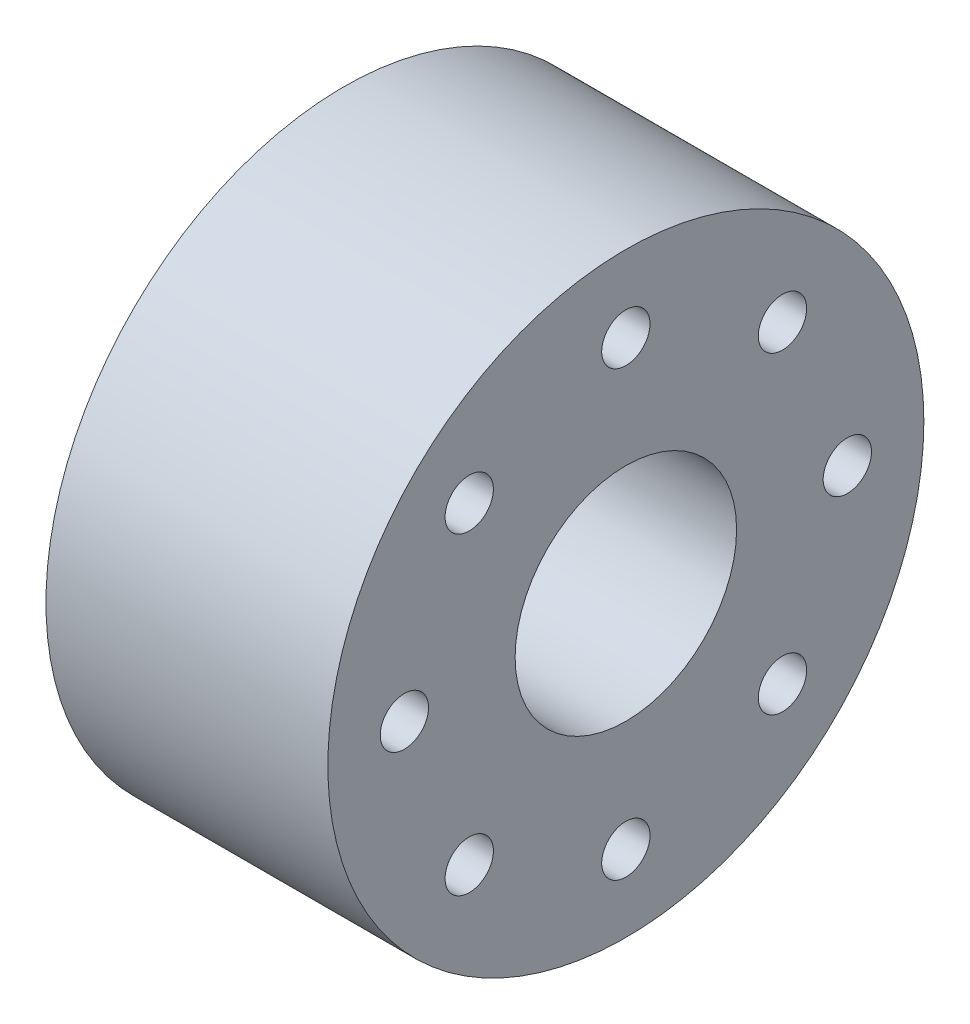
ISO-10303-21;
HEADER;
FILE_DESCRIPTION(('STEP AP214'),'2;1');
FILE_NAME('part.step','',(''),(''),'','','');
FILE_SCHEMA(('AUTOMOTIVE_DESIGN { 1 0 10303 214 1 1 1 1 }'));
ENDSEC;
DATA;
#1=APPLICATION_CONTEXT('core data for automotive mechanical design processes');
#2=APPLICATION_PROTOCOL_DEFINITION('international standard','automotive_design',2000,#1);
#3=PRODUCT_CONTEXT('',#1,'mechanical');
#4=PRODUCT('Part','Part','',(#3));
#5=PRODUCT_RELATED_PRODUCT_CATEGORY('part','',(#4));
#6=PRODUCT_DEFINITION_FORMATION('','',#4);
#7=PRODUCT_DEFINITION_CONTEXT('part definition',#1,'design');
#8=PRODUCT_DEFINITION('design','',#6,#7);
#9=PRODUCT_DEFINITION_SHAPE('','',#8);
#10=(LENGTH_UNIT() NAMED_UNIT(*) SI_UNIT(.MILLI.,.METRE.));
#11=(NAMED_UNIT(*) PLANE_ANGLE_UNIT() SI_UNIT($,.RADIAN.));
#12=(NAMED_UNIT(*) SI_UNIT($,.STERADIAN.) SOLID_ANGLE_UNIT());
#13=UNCERTAINTY_MEASURE_WITH_UNIT(LENGTH_MEASURE(1.E-05),#10,'distance_accuracy_value','');
#14=(GEOMETRIC_REPRESENTATION_CONTEXT(3) GLOBAL_UNCERTAINTY_ASSIGNED_CONTEXT((#13)) GLOBAL_UNIT_ASSIGNED_CONTEXT((#10,
#11,#12)) REPRESENTATION_CONTEXT('',''));
#15=CARTESIAN_POINT('',(0.,0.,0.));
#16=DIRECTION('',(0.,0.,1.));
#17=DIRECTION('',(1.,0.,0.));
#18=AXIS2_PLACEMENT_3D('',#15,#16,#17);
#19=CARTESIAN_POINT('',(14.,0.,0.));
#20=DIRECTION('',(-1.,0.,0.));
#21=DIRECTION('',(0.,0.,1.));
#22=AXIS2_PLACEMENT_3D('',#19,#20,#21);
#23=CYLINDRICAL_SURFACE('',#22,14.8);
#24=CARTESIAN_POINT('',(14.,0.,0.));
#25=DIRECTION('',(1.,0.,0.));
#26=DIRECTION('',(0.,0.,-1.));
#27=AXIS2_PLACEMENT_3D('',#24,#25,#26);
#28=CIRCLE('',#27,14.8);
#29=CARTESIAN_POINT('',(14.,0.,-14.8));
#30=VERTEX_POINT('',#29);
#31=EDGE_CURVE('E10',#30,#30,#28,.T.);
#32=ORIENTED_EDGE('',*,*,#31,.F.);
#33=EDGE_LOOP('',(#32));
#34=FACE_BOUND('',#33,.T.);
#35=CARTESIAN_POINT('',(0.,0.,0.));
#36=DIRECTION('',(1.,0.,0.));
#37=DIRECTION('',(0.,0.,-1.));
#38=AXIS2_PLACEMENT_3D('',#35,#36,#37);
#39=CIRCLE('',#38,14.8);
#40=CARTESIAN_POINT('',(0.,0.,-14.8));
#41=VERTEX_POINT('',#40);
#42=EDGE_CURVE('E49',#41,#41,#39,.T.);
#43=ORIENTED_EDGE('',*,*,#42,.T.);
#44=EDGE_LOOP('',(#43));
#45=FACE_BOUND('',#44,.T.);
#46=ADVANCED_FACE('F41',(#34,#45),#23,.T.);
#47=CARTESIAN_POINT('',(14.,0.,0.));
#48=DIRECTION('',(1.,0.,0.));
#49=DIRECTION('',(0.,0.,-1.));
#50=AXIS2_PLACEMENT_3D('',#47,#48,#49);
#51=PLANE('',#50);
#52=CARTESIAN_POINT('',(14.,0.,0.));
#53=DIRECTION('',(1.,0.,0.));
#54=DIRECTION('',(0.,0.,-1.));
#55=AXIS2_PLACEMENT_3D('',#52,#53,#54);
#56=CIRCLE('',#55,5.5);
#57=CARTESIAN_POINT('',(14.,0.,-5.5));
#58=VERTEX_POINT('',#57);
#59=EDGE_CURVE('E80',#58,#58,#56,.F.);
#60=ORIENTED_EDGE('',*,*,#59,.T.);
#61=EDGE_LOOP('',(#60));
#62=FACE_BOUND('',#61,.T.);
#63=CARTESIAN_POINT('',(14.,11.,0.));
#64=DIRECTION('',(1.,0.,0.));
#65=DIRECTION('',(0.,0.,-1.));
#66=AXIS2_PLACEMENT_3D('',#63,#64,#65);
#67=CIRCLE('',#66,1.2);
#68=CARTESIAN_POINT('',(14.,11.,-1.2));
#69=VERTEX_POINT('',#68);
#70=EDGE_CURVE('E55',#69,#69,#67,.T.);
#71=ORIENTED_EDGE('',*,*,#70,.F.);
#72=EDGE_LOOP('',(#71));
#73=FACE_BOUND('',#72,.T.);
#74=CARTESIAN_POINT('',(14.,7.77817459305212,-7.77817459305192));
#75=DIRECTION('',(1.,0.,0.));
#76=DIRECTION('',(0.,0.,-1.));
#77=AXIS2_PLACEMENT_3D('',#74,#75,#76);
#78=CIRCLE('',#77,1.2);
#79=CARTESIAN_POINT('',(14.,7.77817459305212,-8.97817459305193));
#80=VERTEX_POINT('',#79);
#81=EDGE_CURVE('E130',#80,#80,#78,.T.);
#82=ORIENTED_EDGE('',*,*,#81,.F.);
#83=EDGE_LOOP('',(#82));
#84=FACE_BOUND('',#83,.T.);
#85=CARTESIAN_POINT('',(14.,0.,-11.));
#86=DIRECTION('',(1.,0.,0.));
#87=DIRECTION('',(0.,0.,-1.));
#88=AXIS2_PLACEMENT_3D('',#85,#86,#87);
#89=CIRCLE('',#88,1.2);
#90=CARTESIAN_POINT('',(14.,0.,-12.2));
#91=VERTEX_POINT('',#90);
#92=EDGE_CURVE('E127',#91,#91,#89,.T.);
#93=ORIENTED_EDGE('',*,*,#92,.F.);
#94=EDGE_LOOP('',(#93));
#95=FACE_BOUND('',#94,.T.);
#96=CARTESIAN_POINT('',(14.,-7.77817459305184,-7.7781745930522));
#97=DIRECTION('',(1.,0.,0.));
#98=DIRECTION('',(0.,0.,-1.));
#99=AXIS2_PLACEMENT_3D('',#96,#97,#98);
#100=CIRCLE('',#99,1.2);
#101=CARTESIAN_POINT('',(14.,-7.77817459305184,-8.97817459305221));
#102=VERTEX_POINT('',#101);
#103=EDGE_CURVE('E123',#102,#102,#100,.T.);
#104=ORIENTED_EDGE('',*,*,#103,.F.);
#105=EDGE_LOOP('',(#104));
#106=FACE_BOUND('',#105,.T.);
#107=CARTESIAN_POINT('',(14.,-11.,0.));
#108=DIRECTION('',(1.,0.,0.));
#109=DIRECTION('',(0.,0.,-1.));
#110=AXIS2_PLACEMENT_3D('',#107,#108,#109);
#111=CIRCLE('',#110,1.2);
#112=CARTESIAN_POINT('',(14.,-11.,-1.19999999999992));
#113=VERTEX_POINT('',#112);
#114=EDGE_CURVE('E119',#113,#113,#111,.T.);
#115=ORIENTED_EDGE('',*,*,#114,.F.);
#116=EDGE_LOOP('',(#115));
#117=FACE_BOUND('',#116,.T.);
#118=CARTESIAN_POINT('',(14.,-7.77817459305196,7.77817459305209));
#119=DIRECTION('',(1.,0.,0.));
#120=DIRECTION('',(0.,0.,-1.));
#121=AXIS2_PLACEMENT_3D('',#118,#119,#120);
#122=CIRCLE('',#121,1.2);
#123=CARTESIAN_POINT('',(14.,-7.77817459305196,6.57817459305209));
#124=VERTEX_POINT('',#123);
#125=EDGE_CURVE('E115',#124,#124,#122,.T.);
#126=ORIENTED_EDGE('',*,*,#125,.F.);
#127=EDGE_LOOP('',(#126));
#128=FACE_BOUND('',#127,.T.);
#129=CARTESIAN_POINT('',(14.,1.13575815419154E-13,11.));
#130=DIRECTION('',(1.,0.,0.));
#131=DIRECTION('',(0.,0.,-1.));
#132=AXIS2_PLACEMENT_3D('',#129,#130,#131);
#133=CIRCLE('',#132,1.2);
#134=CARTESIAN_POINT('',(14.,1.13575815419154E-13,9.8));
#135=VERTEX_POINT('',#134);
#136=EDGE_CURVE('E111',#135,#135,#133,.T.);
#137=ORIENTED_EDGE('',*,*,#136,.F.);
#138=EDGE_LOOP('',(#137));
#139=FACE_BOUND('',#138,.T.);
#140=CARTESIAN_POINT('',(14.,7.77817459305212,7.77817459305193));
#141=DIRECTION('',(1.,0.,0.));
#142=DIRECTION('',(0.,0.,-1.));
#143=AXIS2_PLACEMENT_3D('',#140,#141,#142);
#144=CIRCLE('',#143,1.2);
#145=CARTESIAN_POINT('',(14.,7.77817459305212,6.57817459305193));
#146=VERTEX_POINT('',#145);
#147=EDGE_CURVE('E96',#146,#146,#144,.T.);
#148=ORIENTED_EDGE('',*,*,#147,.F.);
#149=EDGE_LOOP('',(#148));
#150=FACE_BOUND('',#149,.T.);
#151=ORIENTED_EDGE('',*,*,#31,.T.);
#152=EDGE_LOOP('',(#151));
#153=FACE_BOUND('',#152,.T.);
#154=ADVANCED_FACE('F142',(#62,#73,#84,#95,#106,#117,#128,#139,#150,#153),#51,.T.);
#155=CARTESIAN_POINT('',(0.,0.,0.));
#156=DIRECTION('',(1.,0.,0.));
#157=DIRECTION('',(0.,0.,-1.));
#158=AXIS2_PLACEMENT_3D('',#155,#156,#157);
#159=PLANE('',#158);
#160=CARTESIAN_POINT('',(0.,7.77817459305212,7.77817459305193));
#161=DIRECTION('',(1.,0.,0.));
#162=DIRECTION('',(0.,0.,-1.));
#163=AXIS2_PLACEMENT_3D('',#160,#161,#162);
#164=CIRCLE('',#163,2.5);
#165=CARTESIAN_POINT('',(0.,7.77817459305212,5.27817459305193));
#166=VERTEX_POINT('',#165);
#167=EDGE_CURVE('E395',#166,#166,#164,.T.);
#168=ORIENTED_EDGE('',*,*,#167,.T.);
#169=EDGE_LOOP('',(#168));
#170=FACE_BOUND('',#169,.T.);
#171=CARTESIAN_POINT('',(0.,-7.77817459305184,-7.7781745930522));
#172=DIRECTION('',(1.,0.,0.));
#173=DIRECTION('',(0.,0.,-1.));
#174=AXIS2_PLACEMENT_3D('',#171,#172,#173);
#175=CIRCLE('',#174,2.5);
#176=CARTESIAN_POINT('',(0.,-7.77817459305184,-10.2781745930522));
#177=VERTEX_POINT('',#176);
#178=EDGE_CURVE('E422',#177,#177,#175,.T.);
#179=ORIENTED_EDGE('',*,*,#178,.T.);
#180=EDGE_LOOP('',(#179));
#181=FACE_BOUND('',#180,.T.);
#182=CARTESIAN_POINT('',(0.,-7.77817459305196,7.77817459305209));
#183=DIRECTION('',(1.,0.,0.));
#184=DIRECTION('',(0.,0.,-1.));
#185=AXIS2_PLACEMENT_3D('',#182,#183,#184);
#186=CIRCLE('',#185,2.5);
#187=CARTESIAN_POINT('',(0.,-7.77817459305196,5.27817459305209));
#188=VERTEX_POINT('',#187);
#189=EDGE_CURVE('E411',#188,#188,#186,.T.);
#190=ORIENTED_EDGE('',*,*,#189,.T.);
#191=EDGE_LOOP('',(#190));
#192=FACE_BOUND('',#191,.T.);
#193=CARTESIAN_POINT('',(0.,7.77817459305212,-7.77817459305192));
#194=DIRECTION('',(1.,0.,0.));
#195=DIRECTION('',(0.,0.,-1.));
#196=AXIS2_PLACEMENT_3D('',#193,#194,#195);
#197=CIRCLE('',#196,2.5);
#198=CARTESIAN_POINT('',(0.,7.77817459305212,-10.2781745930519));
#199=VERTEX_POINT('',#198);
#200=EDGE_CURVE('E65',#199,#199,#197,.T.);
#201=ORIENTED_EDGE('',*,*,#200,.T.);
#202=EDGE_LOOP('',(#201));
#203=FACE_BOUND('',#202,.T.);
#204=CARTESIAN_POINT('',(0.,0.,0.));
#205=DIRECTION('',(-1.,0.,0.));
#206=DIRECTION('',(0.,0.,1.));
#207=AXIS2_PLACEMENT_3D('',#204,#205,#206);
#208=CIRCLE('',#207,5.5);
#209=CARTESIAN_POINT('',(0.,0.,5.5));
#210=VERTEX_POINT('',#209);
#211=EDGE_CURVE('E75',#210,#210,#208,.T.);
#212=ORIENTED_EDGE('',*,*,#211,.F.);
#213=EDGE_LOOP('',(#212));
#214=FACE_BOUND('',#213,.T.);
#215=CARTESIAN_POINT('',(0.,11.,0.));
#216=DIRECTION('',(1.,0.,0.));
#217=DIRECTION('',(0.,0.,-1.));
#218=AXIS2_PLACEMENT_3D('',#215,#216,#217);
#219=CIRCLE('',#218,1.2);
#220=CARTESIAN_POINT('',(0.,11.,-1.2));
#221=VERTEX_POINT('',#220);
#222=EDGE_CURVE('E92',#221,#221,#219,.T.);
#223=ORIENTED_EDGE('',*,*,#222,.T.);
#224=EDGE_LOOP('',(#223));
#225=FACE_BOUND('',#224,.T.);
#226=CARTESIAN_POINT('',(0.,0.,-11.));
#227=DIRECTION('',(1.,0.,0.));
#228=DIRECTION('',(0.,0.,-1.));
#229=AXIS2_PLACEMENT_3D('',#226,#227,#228);
#230=CIRCLE('',#229,1.2);
#231=CARTESIAN_POINT('',(0.,0.,-12.2));
#232=VERTEX_POINT('',#231);
#233=EDGE_CURVE('E97',#232,#232,#230,.T.);
#234=ORIENTED_EDGE('',*,*,#233,.T.);
#235=EDGE_LOOP('',(#234));
#236=FACE_BOUND('',#235,.T.);
#237=CARTESIAN_POINT('',(0.,-11.,0.));
#238=DIRECTION('',(1.,0.,0.));
#239=DIRECTION('',(0.,0.,-1.));
#240=AXIS2_PLACEMENT_3D('',#237,#238,#239);
#241=CIRCLE('',#240,1.2);
#242=CARTESIAN_POINT('',(0.,-11.,-1.19999999999992));
#243=VERTEX_POINT('',#242);
#244=EDGE_CURVE('E101',#243,#243,#241,.T.);
#245=ORIENTED_EDGE('',*,*,#244,.T.);
#246=EDGE_LOOP('',(#245));
#247=FACE_BOUND('',#246,.T.);
#248=CARTESIAN_POINT('',(0.,1.13575815419154E-13,11.));
#249=DIRECTION('',(1.,0.,0.));
#250=DIRECTION('',(0.,0.,-1.));
#251=AXIS2_PLACEMENT_3D('',#248,#249,#250);
#252=CIRCLE('',#251,1.2);
#253=CARTESIAN_POINT('',(0.,1.13575815419154E-13,9.8));
#254=VERTEX_POINT('',#253);
#255=EDGE_CURVE('E86',#254,#254,#252,.T.);
#256=ORIENTED_EDGE('',*,*,#255,.T.);
#257=EDGE_LOOP('',(#256));
#258=FACE_BOUND('',#257,.T.);
#259=ORIENTED_EDGE('',*,*,#42,.F.);
#260=EDGE_LOOP('',(#259));
#261=FACE_BOUND('',#260,.T.);
#262=ADVANCED_FACE('F145',(#170,#181,#192,#203,#214,#225,#236,#247,#258,#261),#159,.F.);
#263=CARTESIAN_POINT('',(0.,7.77817459305212,7.77817459305193));
#264=DIRECTION('',(1.,0.,0.));
#265=DIRECTION('',(0.,0.,-1.));
#266=AXIS2_PLACEMENT_3D('',#263,#264,#265);
#267=CYLINDRICAL_SURFACE('',#266,1.2);
#268=CARTESIAN_POINT('',(5.,7.77817459305212,7.77817459305193));
#269=DIRECTION('',(1.,0.,0.));
#270=DIRECTION('',(0.,0.,-1.));
#271=AXIS2_PLACEMENT_3D('',#268,#269,#270);
#272=CIRCLE('',#271,1.2);
#273=CARTESIAN_POINT('',(5.,7.77817459305212,6.57817459305193));
#274=VERTEX_POINT('',#273);
#275=EDGE_CURVE('E44',#274,#274,#272,.F.);
#276=ORIENTED_EDGE('',*,*,#275,.T.);
#277=EDGE_LOOP('',(#276));
#278=FACE_BOUND('',#277,.T.);
#279=ORIENTED_EDGE('',*,*,#147,.T.);
#280=EDGE_LOOP('',(#279));
#281=FACE_BOUND('',#280,.T.);
#282=ADVANCED_FACE('F161',(#278,#281),#267,.F.);
#283=CARTESIAN_POINT('',(0.,1.13575815419154E-13,11.));
#284=DIRECTION('',(1.,0.,0.));
#285=DIRECTION('',(0.,0.,-1.));
#286=AXIS2_PLACEMENT_3D('',#283,#284,#285);
#287=CYLINDRICAL_SURFACE('',#286,1.2);
#288=ORIENTED_EDGE('',*,*,#136,.T.);
#289=EDGE_LOOP('',(#288));
#290=FACE_BOUND('',#289,.T.);
#291=ORIENTED_EDGE('',*,*,#255,.F.);
#292=EDGE_LOOP('',(#291));
#293=FACE_BOUND('',#292,.T.);
#294=ADVANCED_FACE('F163',(#290,#293),#287,.F.);
#295=CARTESIAN_POINT('',(0.,-7.77817459305196,7.77817459305209));
#296=DIRECTION('',(1.,0.,0.));
#297=DIRECTION('',(0.,0.,-1.));
#298=AXIS2_PLACEMENT_3D('',#295,#296,#297);
#299=CYLINDRICAL_SURFACE('',#298,1.2);
#300=CARTESIAN_POINT('',(5.,-7.77817459305196,7.77817459305209));
#301=DIRECTION('',(1.,0.,0.));
#302=DIRECTION('',(0.,0.,-1.));
#303=AXIS2_PLACEMENT_3D('',#300,#301,#302);
#304=CIRCLE('',#303,1.2);
#305=CARTESIAN_POINT('',(5.,-7.77817459305196,6.57817459305209));
#306=VERTEX_POINT('',#305);
#307=EDGE_CURVE('E68',#306,#306,#304,.F.);
#308=ORIENTED_EDGE('',*,*,#307,.T.);
#309=EDGE_LOOP('',(#308));
#310=FACE_BOUND('',#309,.T.);
#311=ORIENTED_EDGE('',*,*,#125,.T.);
#312=EDGE_LOOP('',(#311));
#313=FACE_BOUND('',#312,.T.);
#314=ADVANCED_FACE('F169',(#310,#313),#299,.F.);
#315=CARTESIAN_POINT('',(0.,-11.,0.));
#316=DIRECTION('',(1.,0.,0.));
#317=DIRECTION('',(0.,0.,-1.));
#318=AXIS2_PLACEMENT_3D('',#315,#316,#317);
#319=CYLINDRICAL_SURFACE('',#318,1.2);
#320=ORIENTED_EDGE('',*,*,#114,.T.);
#321=EDGE_LOOP('',(#320));
#322=FACE_BOUND('',#321,.T.);
#323=ORIENTED_EDGE('',*,*,#244,.F.);
#324=EDGE_LOOP('',(#323));
#325=FACE_BOUND('',#324,.T.);
#326=ADVANCED_FACE('F210',(#322,#325),#319,.F.);
#327=CARTESIAN_POINT('',(0.,-7.77817459305184,-7.7781745930522));
#328=DIRECTION('',(1.,0.,0.));
#329=DIRECTION('',(0.,0.,-1.));
#330=AXIS2_PLACEMENT_3D('',#327,#328,#329);
#331=CYLINDRICAL_SURFACE('',#330,1.2);
#332=CARTESIAN_POINT('',(5.,-7.77817459305184,-7.7781745930522));
#333=DIRECTION('',(1.,0.,0.));
#334=DIRECTION('',(0.,0.,-1.));
#335=AXIS2_PLACEMENT_3D('',#332,#333,#334);
#336=CIRCLE('',#335,1.2);
#337=CARTESIAN_POINT('',(5.,-7.77817459305184,-8.97817459305221));
#338=VERTEX_POINT('',#337);
#339=EDGE_CURVE('E64',#338,#338,#336,.F.);
#340=ORIENTED_EDGE('',*,*,#339,.T.);
#341=EDGE_LOOP('',(#340));
#342=FACE_BOUND('',#341,.T.);
#343=ORIENTED_EDGE('',*,*,#103,.T.);
#344=EDGE_LOOP('',(#343));
#345=FACE_BOUND('',#344,.T.);
#346=ADVANCED_FACE('F218',(#342,#345),#331,.F.);
#347=CARTESIAN_POINT('',(0.,0.,-11.));
#348=DIRECTION('',(1.,0.,0.));
#349=DIRECTION('',(0.,0.,-1.));
#350=AXIS2_PLACEMENT_3D('',#347,#348,#349);
#351=CYLINDRICAL_SURFACE('',#350,1.2);
#352=ORIENTED_EDGE('',*,*,#92,.T.);
#353=EDGE_LOOP('',(#352));
#354=FACE_BOUND('',#353,.T.);
#355=ORIENTED_EDGE('',*,*,#233,.F.);
#356=EDGE_LOOP('',(#355));
#357=FACE_BOUND('',#356,.T.);
#358=ADVANCED_FACE('F223',(#354,#357),#351,.F.);
#359=CARTESIAN_POINT('',(0.,7.77817459305212,-7.77817459305192));
#360=DIRECTION('',(1.,0.,0.));
#361=DIRECTION('',(0.,0.,-1.));
#362=AXIS2_PLACEMENT_3D('',#359,#360,#361);
#363=CYLINDRICAL_SURFACE('',#362,1.2);
#364=CARTESIAN_POINT('',(5.,7.77817459305212,-7.77817459305192));
#365=DIRECTION('',(1.,0.,0.));
#366=DIRECTION('',(0.,0.,-1.));
#367=AXIS2_PLACEMENT_3D('',#364,#365,#366);
#368=CIRCLE('',#367,1.2);
#369=CARTESIAN_POINT('',(5.,7.77817459305212,-8.97817459305193));
#370=VERTEX_POINT('',#369);
#371=EDGE_CURVE('E60',#370,#370,#368,.F.);
#372=ORIENTED_EDGE('',*,*,#371,.T.);
#373=EDGE_LOOP('',(#372));
#374=FACE_BOUND('',#373,.T.);
#375=ORIENTED_EDGE('',*,*,#81,.T.);
#376=EDGE_LOOP('',(#375));
#377=FACE_BOUND('',#376,.T.);
#378=ADVANCED_FACE('F232',(#374,#377),#363,.F.);
#379=CARTESIAN_POINT('',(0.,11.,0.));
#380=DIRECTION('',(1.,0.,0.));
#381=DIRECTION('',(0.,0.,-1.));
#382=AXIS2_PLACEMENT_3D('',#379,#380,#381);
#383=CYLINDRICAL_SURFACE('',#382,1.2);
#384=ORIENTED_EDGE('',*,*,#70,.T.);
#385=EDGE_LOOP('',(#384));
#386=FACE_BOUND('',#385,.T.);
#387=ORIENTED_EDGE('',*,*,#222,.F.);
#388=EDGE_LOOP('',(#387));
#389=FACE_BOUND('',#388,.T.);
#390=ADVANCED_FACE('F139',(#386,#389),#383,.F.);
#391=CARTESIAN_POINT('',(29.556349186104,0.,0.));
#392=DIRECTION('',(-1.,0.,0.));
#393=DIRECTION('',(0.,0.,1.));
#394=AXIS2_PLACEMENT_3D('',#391,#392,#393);
#395=CYLINDRICAL_SURFACE('',#394,5.5);
#396=ORIENTED_EDGE('',*,*,#211,.T.);
#397=EDGE_LOOP('',(#396));
#398=FACE_BOUND('',#397,.T.);
#399=ORIENTED_EDGE('',*,*,#59,.F.);
#400=EDGE_LOOP('',(#399));
#401=FACE_BOUND('',#400,.T.);
#402=ADVANCED_FACE('F196',(#398,#401),#395,.F.);
#403=CARTESIAN_POINT('',(5.,7.77817459305212,-7.77817459305192));
#404=DIRECTION('',(1.,0.,0.));
#405=DIRECTION('',(0.,0.,-1.));
#406=AXIS2_PLACEMENT_3D('',#403,#404,#405);
#407=PLANE('',#406);
#408=CARTESIAN_POINT('',(5.,7.77817459305212,-7.77817459305192));
#409=DIRECTION('',(1.,0.,0.));
#410=DIRECTION('',(0.,0.,-1.));
#411=AXIS2_PLACEMENT_3D('',#408,#409,#410);
#412=CIRCLE('',#411,2.5);
#413=CARTESIAN_POINT('',(5.,7.77817459305212,-10.2781745930519));
#414=VERTEX_POINT('',#413);
#415=EDGE_CURVE('E89',#414,#414,#412,.T.);
#416=ORIENTED_EDGE('',*,*,#415,.F.);
#417=EDGE_LOOP('',(#416));
#418=FACE_BOUND('',#417,.T.);
#419=ORIENTED_EDGE('',*,*,#371,.F.);
#420=EDGE_LOOP('',(#419));
#421=FACE_BOUND('',#420,.T.);
#422=ADVANCED_FACE('F245',(#418,#421),#407,.F.);
#423=CARTESIAN_POINT('',(0.,7.77817459305212,-7.77817459305192));
#424=DIRECTION('',(1.,0.,0.));
#425=DIRECTION('',(0.,0.,-1.));
#426=AXIS2_PLACEMENT_3D('',#423,#424,#425);
#427=CYLINDRICAL_SURFACE('',#426,2.5);
#428=ORIENTED_EDGE('',*,*,#200,.F.);
#429=EDGE_LOOP('',(#428));
#430=FACE_BOUND('',#429,.T.);
#431=ORIENTED_EDGE('',*,*,#415,.T.);
#432=EDGE_LOOP('',(#431));
#433=FACE_BOUND('',#432,.T.);
#434=ADVANCED_FACE('F250',(#430,#433),#427,.F.);
#435=CARTESIAN_POINT('',(5.,-7.77817459305184,-7.7781745930522));
#436=DIRECTION('',(1.,0.,0.));
#437=DIRECTION('',(0.,0.,-1.));
#438=AXIS2_PLACEMENT_3D('',#435,#436,#437);
#439=PLANE('',#438);
#440=CARTESIAN_POINT('',(5.,-7.77817459305184,-7.7781745930522));
#441=DIRECTION('',(1.,0.,0.));
#442=DIRECTION('',(0.,0.,-1.));
#443=AXIS2_PLACEMENT_3D('',#440,#441,#442);
#444=CIRCLE('',#443,2.5);
#445=CARTESIAN_POINT('',(5.,-7.77817459305184,-10.2781745930522));
#446=VERTEX_POINT('',#445);
#447=EDGE_CURVE('E402',#446,#446,#444,.T.);
#448=ORIENTED_EDGE('',*,*,#447,.F.);
#449=EDGE_LOOP('',(#448));
#450=FACE_BOUND('',#449,.T.);
#451=ORIENTED_EDGE('',*,*,#339,.F.);
#452=EDGE_LOOP('',(#451));
#453=FACE_BOUND('',#452,.T.);
#454=ADVANCED_FACE('F261',(#450,#453),#439,.F.);
#455=CARTESIAN_POINT('',(0.,-7.77817459305184,-7.7781745930522));
#456=DIRECTION('',(1.,0.,0.));
#457=DIRECTION('',(0.,0.,-1.));
#458=AXIS2_PLACEMENT_3D('',#455,#456,#457);
#459=CYLINDRICAL_SURFACE('',#458,2.5);
#460=ORIENTED_EDGE('',*,*,#178,.F.);
#461=EDGE_LOOP('',(#460));
#462=FACE_BOUND('',#461,.T.);
#463=ORIENTED_EDGE('',*,*,#447,.T.);
#464=EDGE_LOOP('',(#463));
#465=FACE_BOUND('',#464,.T.);
#466=ADVANCED_FACE('F272',(#462,#465),#459,.F.);
#467=CARTESIAN_POINT('',(5.,-7.77817459305196,7.77817459305209));
#468=DIRECTION('',(1.,0.,0.));
#469=DIRECTION('',(0.,0.,-1.));
#470=AXIS2_PLACEMENT_3D('',#467,#468,#469);
#471=PLANE('',#470);
#472=CARTESIAN_POINT('',(5.,-7.77817459305196,7.77817459305209));
#473=DIRECTION('',(1.,0.,0.));
#474=DIRECTION('',(0.,0.,-1.));
#475=AXIS2_PLACEMENT_3D('',#472,#473,#474);
#476=CIRCLE('',#475,2.5);
#477=CARTESIAN_POINT('',(5.,-7.77817459305196,5.27817459305209));
#478=VERTEX_POINT('',#477);
#479=EDGE_CURVE('E416',#478,#478,#476,.T.);
#480=ORIENTED_EDGE('',*,*,#479,.F.);
#481=EDGE_LOOP('',(#480));
#482=FACE_BOUND('',#481,.T.);
#483=ORIENTED_EDGE('',*,*,#307,.F.);
#484=EDGE_LOOP('',(#483));
#485=FACE_BOUND('',#484,.T.);
#486=ADVANCED_FACE('F283',(#482,#485),#471,.F.);
#487=CARTESIAN_POINT('',(0.,-7.77817459305196,7.77817459305209));
#488=DIRECTION('',(1.,0.,0.));
#489=DIRECTION('',(0.,0.,-1.));
#490=AXIS2_PLACEMENT_3D('',#487,#488,#489);
#491=CYLINDRICAL_SURFACE('',#490,2.5);
#492=ORIENTED_EDGE('',*,*,#189,.F.);
#493=EDGE_LOOP('',(#492));
#494=FACE_BOUND('',#493,.T.);
#495=ORIENTED_EDGE('',*,*,#479,.T.);
#496=EDGE_LOOP('',(#495));
#497=FACE_BOUND('',#496,.T.);
#498=ADVANCED_FACE('F294',(#494,#497),#491,.F.);
#499=CARTESIAN_POINT('',(5.,7.77817459305212,7.77817459305193));
#500=DIRECTION('',(1.,0.,0.));
#501=DIRECTION('',(0.,0.,-1.));
#502=AXIS2_PLACEMENT_3D('',#499,#500,#501);
#503=PLANE('',#502);
#504=CARTESIAN_POINT('',(5.,7.77817459305212,7.77817459305193));
#505=DIRECTION('',(1.,0.,0.));
#506=DIRECTION('',(0.,0.,-1.));
#507=AXIS2_PLACEMENT_3D('',#504,#505,#506);
#508=CIRCLE('',#507,2.5);
#509=CARTESIAN_POINT('',(5.,7.77817459305212,5.27817459305193));
#510=VERTEX_POINT('',#509);
#511=EDGE_CURVE('E398',#510,#510,#508,.T.);
#512=ORIENTED_EDGE('',*,*,#511,.F.);
#513=EDGE_LOOP('',(#512));
#514=FACE_BOUND('',#513,.T.);
#515=ORIENTED_EDGE('',*,*,#275,.F.);
#516=EDGE_LOOP('',(#515));
#517=FACE_BOUND('',#516,.T.);
#518=ADVANCED_FACE('F305',(#514,#517),#503,.F.);
#519=CARTESIAN_POINT('',(0.,7.77817459305212,7.77817459305193));
#520=DIRECTION('',(1.,0.,0.));
#521=DIRECTION('',(0.,0.,-1.));
#522=AXIS2_PLACEMENT_3D('',#519,#520,#521);
#523=CYLINDRICAL_SURFACE('',#522,2.5);
#524=ORIENTED_EDGE('',*,*,#167,.F.);
#525=EDGE_LOOP('',(#524));
#526=FACE_BOUND('',#525,.T.);
#527=ORIENTED_EDGE('',*,*,#511,.T.);
#528=EDGE_LOOP('',(#527));
#529=FACE_BOUND('',#528,.T.);
#530=ADVANCED_FACE('F316',(#526,#529),#523,.F.);
#531=CLOSED_SHELL('',(#46,#154,#262,#282,#294,#314,#326,#346,#358,#378,#390,#402,#422,#434,#454,
#466,#486,#498,#518,#530));
#532=MANIFOLD_SOLID_BREP('B2',#531);
#533=ADVANCED_BREP_SHAPE_REPRESENTATION('',(#18,#532),#14);
#534=SHAPE_DEFINITION_REPRESENTATION(#9,#533);
ENDSEC;
END-ISO-10303-21;
